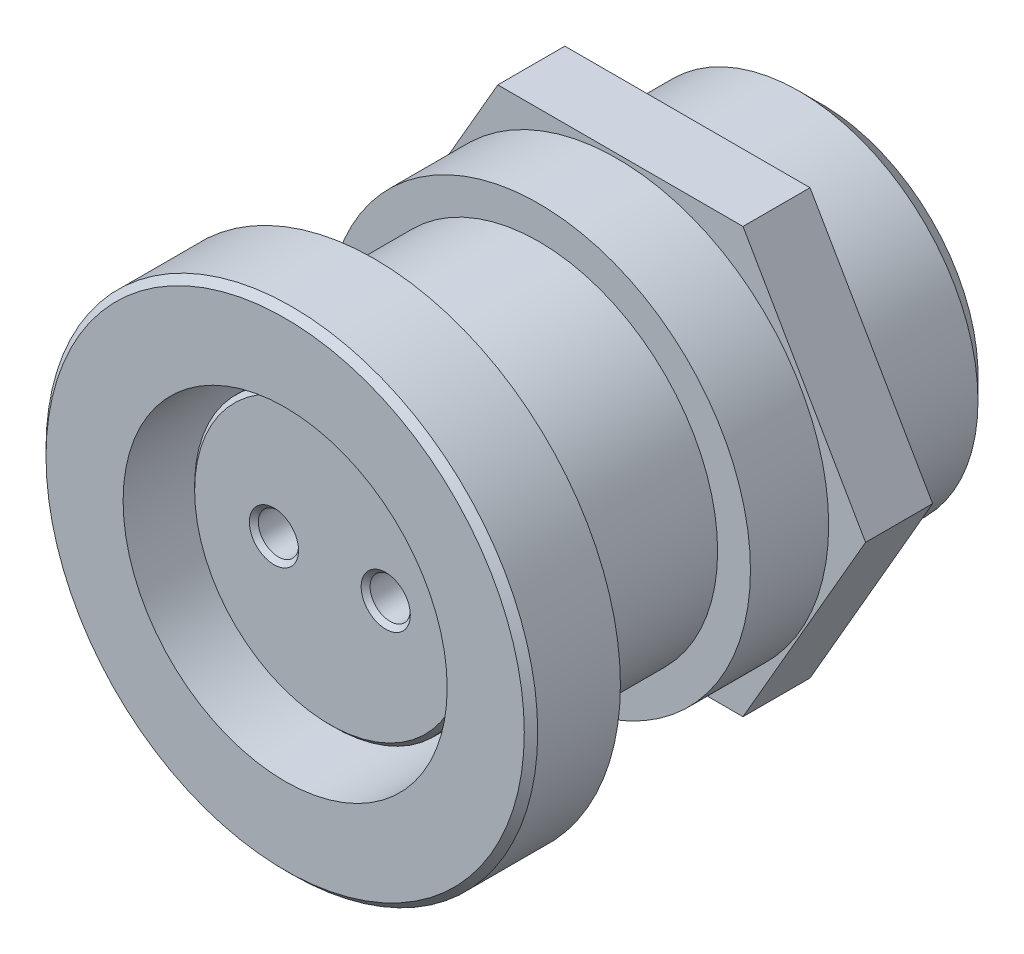
ISO-10303-21;
HEADER;
FILE_DESCRIPTION(('STEP AP214'),'2;1');
FILE_NAME('part.step','',(''),(''),'','','');
FILE_SCHEMA(('AUTOMOTIVE_DESIGN { 1 0 10303 214 1 1 1 1 }'));
ENDSEC;
DATA;
#1=APPLICATION_CONTEXT('core data for automotive mechanical design processes');
#2=APPLICATION_PROTOCOL_DEFINITION('international standard','automotive_design',2000,#1);
#3=PRODUCT_CONTEXT('',#1,'mechanical');
#4=PRODUCT('Part','Part','',(#3));
#5=PRODUCT_RELATED_PRODUCT_CATEGORY('part','',(#4));
#6=PRODUCT_DEFINITION_FORMATION('','',#4);
#7=PRODUCT_DEFINITION_CONTEXT('part definition',#1,'design');
#8=PRODUCT_DEFINITION('design','',#6,#7);
#9=PRODUCT_DEFINITION_SHAPE('','',#8);
#10=(LENGTH_UNIT() NAMED_UNIT(*) SI_UNIT(.MILLI.,.METRE.));
#11=(NAMED_UNIT(*) PLANE_ANGLE_UNIT() SI_UNIT($,.RADIAN.));
#12=(NAMED_UNIT(*) SI_UNIT($,.STERADIAN.) SOLID_ANGLE_UNIT());
#13=UNCERTAINTY_MEASURE_WITH_UNIT(LENGTH_MEASURE(1.E-05),#10,'distance_accuracy_value','');
#14=(GEOMETRIC_REPRESENTATION_CONTEXT(3) GLOBAL_UNCERTAINTY_ASSIGNED_CONTEXT((#13)) GLOBAL_UNIT_ASSIGNED_CONTEXT((#10,
#11,#12)) REPRESENTATION_CONTEXT('',''));
#15=CARTESIAN_POINT('',(0.,0.,0.));
#16=DIRECTION('',(0.,0.,1.));
#17=DIRECTION('',(1.,0.,0.));
#18=AXIS2_PLACEMENT_3D('',#15,#16,#17);
#19=CARTESIAN_POINT('',(0.,0.,-20.));
#20=DIRECTION('',(0.,0.,1.));
#21=DIRECTION('',(1.,0.,0.));
#22=AXIS2_PLACEMENT_3D('',#19,#20,#21);
#23=CYLINDRICAL_SURFACE('',#22,8.);
#24=CARTESIAN_POINT('',(0.,0.,0.));
#25=DIRECTION('',(0.,0.,1.));
#26=DIRECTION('',(1.,0.,0.));
#27=AXIS2_PLACEMENT_3D('',#24,#25,#26);
#28=CIRCLE('',#27,8.);
#29=CARTESIAN_POINT('',(8.,0.,0.));
#30=VERTEX_POINT('',#29);
#31=EDGE_CURVE('E186',#30,#30,#28,.F.);
#32=ORIENTED_EDGE('',*,*,#31,.T.);
#33=EDGE_LOOP('',(#32));
#34=FACE_BOUND('',#33,.T.);
#35=CARTESIAN_POINT('',(0.,0.,-7.35));
#36=DIRECTION('',(0.,0.,-1.));
#37=DIRECTION('',(-1.,0.,0.));
#38=AXIS2_PLACEMENT_3D('',#35,#36,#37);
#39=CIRCLE('',#38,8.);
#40=CARTESIAN_POINT('',(-8.,0.,-7.35));
#41=VERTEX_POINT('',#40);
#42=EDGE_CURVE('E42',#41,#41,#39,.T.);
#43=ORIENTED_EDGE('',*,*,#42,.F.);
#44=EDGE_LOOP('',(#43));
#45=FACE_BOUND('',#44,.T.);
#46=ADVANCED_FACE('F34',(#34,#45),#23,.T.);
#47=CARTESIAN_POINT('',(0.,0.,0.));
#48=DIRECTION('',(0.,0.,1.));
#49=DIRECTION('',(1.,0.,0.));
#50=AXIS2_PLACEMENT_3D('',#47,#48,#49);
#51=PLANE('',#50);
#52=CARTESIAN_POINT('',(0.,0.,0.));
#53=DIRECTION('',(0.,0.,-1.));
#54=DIRECTION('',(-1.,0.,0.));
#55=AXIS2_PLACEMENT_3D('',#52,#53,#54);
#56=CIRCLE('',#55,10.);
#57=CARTESIAN_POINT('',(-10.,0.,0.));
#58=VERTEX_POINT('',#57);
#59=EDGE_CURVE('E174',#58,#58,#56,.T.);
#60=ORIENTED_EDGE('',*,*,#59,.F.);
#61=EDGE_LOOP('',(#60));
#62=FACE_BOUND('',#61,.T.);
#63=CARTESIAN_POINT('',(0.,0.,0.));
#64=DIRECTION('',(0.,0.,1.));
#65=DIRECTION('',(1.,0.,0.));
#66=AXIS2_PLACEMENT_3D('',#63,#64,#65);
#67=CIRCLE('',#66,11.);
#68=CARTESIAN_POINT('',(11.,0.,0.));
#69=VERTEX_POINT('',#68);
#70=EDGE_CURVE('E183',#69,#69,#67,.T.);
#71=ORIENTED_EDGE('',*,*,#70,.F.);
#72=EDGE_LOOP('',(#71));
#73=FACE_BOUND('',#72,.T.);
#74=ADVANCED_FACE('F241',(#62,#73),#51,.F.);
#75=CARTESIAN_POINT('',(0.,0.,4.));
#76=DIRECTION('',(0.,0.,-1.));
#77=DIRECTION('',(-1.,0.,0.));
#78=AXIS2_PLACEMENT_3D('',#75,#76,#77);
#79=CYLINDRICAL_SURFACE('',#78,11.);
#80=CARTESIAN_POINT('',(0.,0.,3.7));
#81=DIRECTION('',(0.,0.,1.));
#82=DIRECTION('',(1.,0.,0.));
#83=AXIS2_PLACEMENT_3D('',#80,#81,#82);
#84=CIRCLE('',#83,11.);
#85=CARTESIAN_POINT('',(11.,0.,3.7));
#86=VERTEX_POINT('',#85);
#87=EDGE_CURVE('E198',#86,#86,#84,.F.);
#88=ORIENTED_EDGE('',*,*,#87,.T.);
#89=EDGE_LOOP('',(#88));
#90=FACE_BOUND('',#89,.T.);
#91=ORIENTED_EDGE('',*,*,#70,.T.);
#92=EDGE_LOOP('',(#91));
#93=FACE_BOUND('',#92,.T.);
#94=ADVANCED_FACE('F36',(#90,#93),#79,.T.);
#95=CARTESIAN_POINT('',(0.,0.,4.));
#96=DIRECTION('',(0.,0.,1.));
#97=DIRECTION('',(1.,0.,0.));
#98=AXIS2_PLACEMENT_3D('',#95,#96,#97);
#99=PLANE('',#98);
#100=CARTESIAN_POINT('',(0.,0.,4.));
#101=DIRECTION('',(0.,0.,1.));
#102=DIRECTION('',(1.,0.,0.));
#103=AXIS2_PLACEMENT_3D('',#100,#101,#102);
#104=CIRCLE('',#103,10.7);
#105=CARTESIAN_POINT('',(10.7,0.,4.));
#106=VERTEX_POINT('',#105);
#107=EDGE_CURVE('E195',#106,#106,#104,.T.);
#108=ORIENTED_EDGE('',*,*,#107,.T.);
#109=EDGE_LOOP('',(#108));
#110=FACE_BOUND('',#109,.T.);
#111=CARTESIAN_POINT('',(0.,0.,4.));
#112=DIRECTION('',(0.,0.,1.));
#113=DIRECTION('',(1.,0.,0.));
#114=AXIS2_PLACEMENT_3D('',#111,#112,#113);
#115=CIRCLE('',#114,7.25);
#116=CARTESIAN_POINT('',(7.25,0.,4.));
#117=VERTEX_POINT('',#116);
#118=EDGE_CURVE('E180',#117,#117,#115,.T.);
#119=ORIENTED_EDGE('',*,*,#118,.F.);
#120=EDGE_LOOP('',(#119));
#121=FACE_BOUND('',#120,.T.);
#122=ADVANCED_FACE('F339',(#110,#121),#99,.T.);
#123=CARTESIAN_POINT('',(0.,0.,-12.));
#124=DIRECTION('',(0.,0.,1.));
#125=DIRECTION('',(1.,0.,0.));
#126=AXIS2_PLACEMENT_3D('',#123,#124,#125);
#127=CYLINDRICAL_SURFACE('',#126,7.25);
#128=CARTESIAN_POINT('',(0.,0.,-11.));
#129=DIRECTION('',(0.,0.,1.));
#130=DIRECTION('',(1.,0.,0.));
#131=AXIS2_PLACEMENT_3D('',#128,#129,#130);
#132=CIRCLE('',#131,7.25);
#133=CARTESIAN_POINT('',(7.25,0.,-11.));
#134=VERTEX_POINT('',#133);
#135=EDGE_CURVE('E144',#134,#134,#132,.F.);
#136=ORIENTED_EDGE('',*,*,#135,.T.);
#137=EDGE_LOOP('',(#136));
#138=FACE_BOUND('',#137,.T.);
#139=ORIENTED_EDGE('',*,*,#118,.T.);
#140=EDGE_LOOP('',(#139));
#141=FACE_BOUND('',#140,.T.);
#142=ADVANCED_FACE('F325',(#138,#141),#127,.F.);
#143=CARTESIAN_POINT('',(0.,0.,4.));
#144=DIRECTION('',(0.,0.,-1.));
#145=DIRECTION('',(-1.,0.,0.));
#146=AXIS2_PLACEMENT_3D('',#143,#144,#145);
#147=CONICAL_SURFACE('',#146,10.7,0.785398163397445);
#148=ORIENTED_EDGE('',*,*,#87,.F.);
#149=EDGE_LOOP('',(#148));
#150=FACE_BOUND('',#149,.T.);
#151=ORIENTED_EDGE('',*,*,#107,.F.);
#152=EDGE_LOOP('',(#151));
#153=FACE_BOUND('',#152,.T.);
#154=ADVANCED_FACE('F321',(#150,#153),#147,.T.);
#155=CARTESIAN_POINT('',(0.,0.,1.5));
#156=DIRECTION('',(0.,0.,-1.));
#157=DIRECTION('',(-1.,0.,0.));
#158=AXIS2_PLACEMENT_3D('',#155,#156,#157);
#159=CYLINDRICAL_SURFACE('',#158,10.);
#160=CARTESIAN_POINT('',(0.,0.,1.5));
#161=DIRECTION('',(0.,0.,-1.));
#162=DIRECTION('',(-1.,0.,0.));
#163=AXIS2_PLACEMENT_3D('',#160,#161,#162);
#164=CIRCLE('',#163,10.);
#165=CARTESIAN_POINT('',(-10.,0.,1.5));
#166=VERTEX_POINT('',#165);
#167=EDGE_CURVE('E177',#166,#166,#164,.T.);
#168=ORIENTED_EDGE('',*,*,#167,.F.);
#169=EDGE_LOOP('',(#168));
#170=FACE_BOUND('',#169,.T.);
#171=ORIENTED_EDGE('',*,*,#59,.T.);
#172=EDGE_LOOP('',(#171));
#173=FACE_BOUND('',#172,.T.);
#174=ADVANCED_FACE('F317',(#170,#173),#159,.F.);
#175=CARTESIAN_POINT('',(0.,0.,1.5));
#176=DIRECTION('',(0.,0.,-1.));
#177=DIRECTION('',(-1.,0.,0.));
#178=AXIS2_PLACEMENT_3D('',#175,#176,#177);
#179=PLANE('',#178);
#180=CARTESIAN_POINT('',(0.,0.,1.5));
#181=DIRECTION('',(0.,0.,-1.));
#182=DIRECTION('',(-1.,0.,0.));
#183=AXIS2_PLACEMENT_3D('',#180,#181,#182);
#184=CIRCLE('',#183,8.25);
#185=CARTESIAN_POINT('',(-8.25,0.,1.5));
#186=VERTEX_POINT('',#185);
#187=EDGE_CURVE('E171',#186,#186,#184,.T.);
#188=ORIENTED_EDGE('',*,*,#187,.F.);
#189=EDGE_LOOP('',(#188));
#190=FACE_BOUND('',#189,.T.);
#191=ORIENTED_EDGE('',*,*,#167,.T.);
#192=EDGE_LOOP('',(#191));
#193=FACE_BOUND('',#192,.T.);
#194=ADVANCED_FACE('F313',(#190,#193),#179,.T.);
#195=CARTESIAN_POINT('',(0.,0.,1.5));
#196=DIRECTION('',(0.,0.,-1.));
#197=DIRECTION('',(-1.,0.,0.));
#198=AXIS2_PLACEMENT_3D('',#195,#196,#197);
#199=CYLINDRICAL_SURFACE('',#198,8.25);
#200=ORIENTED_EDGE('',*,*,#187,.T.);
#201=EDGE_LOOP('',(#200));
#202=FACE_BOUND('',#201,.T.);
#203=CARTESIAN_POINT('',(0.,0.,0.));
#204=DIRECTION('',(0.,0.,-1.));
#205=DIRECTION('',(-1.,0.,0.));
#206=AXIS2_PLACEMENT_3D('',#203,#204,#205);
#207=CIRCLE('',#206,8.25);
#208=CARTESIAN_POINT('',(-8.25,0.,0.));
#209=VERTEX_POINT('',#208);
#210=EDGE_CURVE('E168',#209,#209,#207,.T.);
#211=ORIENTED_EDGE('',*,*,#210,.F.);
#212=EDGE_LOOP('',(#211));
#213=FACE_BOUND('',#212,.T.);
#214=ADVANCED_FACE('F310',(#202,#213),#199,.T.);
#215=ORIENTED_EDGE('',*,*,#31,.F.);
#216=EDGE_LOOP('',(#215));
#217=FACE_BOUND('',#216,.T.);
#218=ORIENTED_EDGE('',*,*,#210,.T.);
#219=EDGE_LOOP('',(#218));
#220=FACE_BOUND('',#219,.T.);
#221=ADVANCED_FACE('F249',(#217,#220),#51,.F.);
#222=CARTESIAN_POINT('',(0.,0.,-10.85));
#223=DIRECTION('',(0.,0.,-1.));
#224=DIRECTION('',(-1.,0.,0.));
#225=AXIS2_PLACEMENT_3D('',#222,#223,#224);
#226=PLANE('',#225);
#227=CARTESIAN_POINT('',(0.,0.,-10.85));
#228=DIRECTION('',(0.,0.,-1.));
#229=DIRECTION('',(-1.,0.,0.));
#230=AXIS2_PLACEMENT_3D('',#227,#228,#229);
#231=CIRCLE('',#230,9.46912805354748);
#232=CARTESIAN_POINT('',(-9.46912805354748,0.,-10.85));
#233=VERTEX_POINT('',#232);
#234=EDGE_CURVE('E153',#233,#233,#231,.T.);
#235=ORIENTED_EDGE('',*,*,#234,.T.);
#236=EDGE_LOOP('',(#235));
#237=FACE_BOUND('',#236,.T.);
#238=CARTESIAN_POINT('',(0.,0.,-10.85));
#239=DIRECTION('',(0.,0.,-1.));
#240=DIRECTION('',(-1.,0.,0.));
#241=AXIS2_PLACEMENT_3D('',#238,#239,#240);
#242=CIRCLE('',#241,8.);
#243=CARTESIAN_POINT('',(-8.,0.,-10.85));
#244=VERTEX_POINT('',#243);
#245=EDGE_CURVE('E147',#244,#244,#242,.T.);
#246=ORIENTED_EDGE('',*,*,#245,.F.);
#247=EDGE_LOOP('',(#246));
#248=FACE_BOUND('',#247,.T.);
#249=ADVANCED_FACE('F377',(#237,#248),#226,.T.);
#250=CARTESIAN_POINT('',(0.,0.,-7.35));
#251=DIRECTION('',(0.,0.,-1.));
#252=DIRECTION('',(-1.,0.,0.));
#253=AXIS2_PLACEMENT_3D('',#250,#251,#252);
#254=PLANE('',#253);
#255=CARTESIAN_POINT('',(0.,0.,-7.35));
#256=DIRECTION('',(0.,0.,-1.));
#257=DIRECTION('',(-1.,0.,0.));
#258=AXIS2_PLACEMENT_3D('',#255,#256,#257);
#259=CIRCLE('',#258,9.46912805354748);
#260=CARTESIAN_POINT('',(-9.46912805354748,0.,-7.35));
#261=VERTEX_POINT('',#260);
#262=EDGE_CURVE('E150',#261,#261,#259,.T.);
#263=ORIENTED_EDGE('',*,*,#262,.F.);
#264=EDGE_LOOP('',(#263));
#265=FACE_BOUND('',#264,.T.);
#266=ORIENTED_EDGE('',*,*,#42,.T.);
#267=EDGE_LOOP('',(#266));
#268=FACE_BOUND('',#267,.T.);
#269=ADVANCED_FACE('F527',(#265,#268),#254,.F.);
#270=CARTESIAN_POINT('',(0.,0.,-10.85));
#271=DIRECTION('',(0.,0.,1.));
#272=DIRECTION('',(1.,0.,0.));
#273=AXIS2_PLACEMENT_3D('',#270,#271,#272);
#274=CYLINDRICAL_SURFACE('',#273,9.46912805354748);
#275=ORIENTED_EDGE('',*,*,#234,.F.);
#276=EDGE_LOOP('',(#275));
#277=FACE_BOUND('',#276,.T.);
#278=ORIENTED_EDGE('',*,*,#262,.T.);
#279=EDGE_LOOP('',(#278));
#280=FACE_BOUND('',#279,.T.);
#281=ADVANCED_FACE('F254',(#277,#280),#274,.T.);
#282=CARTESIAN_POINT('',(0.,0.,-11.));
#283=DIRECTION('',(0.,0.,1.));
#284=DIRECTION('',(1.,0.,0.));
#285=AXIS2_PLACEMENT_3D('',#282,#283,#284);
#286=CIRCLE('',#285,8.);
#287=CARTESIAN_POINT('',(8.,0.,-11.));
#288=VERTEX_POINT('',#287);
#289=EDGE_CURVE('E106',#288,#288,#286,.T.);
#290=ORIENTED_EDGE('',*,*,#289,.T.);
#291=EDGE_LOOP('',(#290));
#292=FACE_BOUND('',#291,.T.);
#293=ORIENTED_EDGE('',*,*,#245,.T.);
#294=EDGE_LOOP('',(#293));
#295=FACE_BOUND('',#294,.T.);
#296=ADVANCED_FACE('F223',(#292,#295),#23,.T.);
#297=CARTESIAN_POINT('',(5.48482755730144,9.5,-14.));
#298=DIRECTION('',(0.,-1.,0.));
#299=DIRECTION('',(0.,0.,-1.));
#300=AXIS2_PLACEMENT_3D('',#297,#298,#299);
#301=PLANE('',#300);
#302=DIRECTION('',(1.,0.,0.));
#303=VECTOR('',#302,1.);
#304=CARTESIAN_POINT('',(5.48482755730144,9.5,-11.));
#305=LINE('',#304,#303);
#306=CARTESIAN_POINT('',(-5.48482755730145,9.5,-11.));
#307=VERTEX_POINT('',#306);
#308=CARTESIAN_POINT('',(5.48482755730144,9.5,-11.));
#309=VERTEX_POINT('',#308);
#310=EDGE_CURVE('E119',#307,#309,#305,.T.);
#311=ORIENTED_EDGE('',*,*,#310,.T.);
#312=DIRECTION('',(0.,0.,1.));
#313=VECTOR('',#312,1.);
#314=CARTESIAN_POINT('',(5.48482755730144,9.5,-14.));
#315=LINE('',#314,#313);
#316=CARTESIAN_POINT('',(5.48482755730144,9.5,-14.));
#317=VERTEX_POINT('',#316);
#318=EDGE_CURVE('E111',#317,#309,#315,.T.);
#319=ORIENTED_EDGE('',*,*,#318,.F.);
#320=DIRECTION('',(1.,0.,0.));
#321=VECTOR('',#320,1.);
#322=CARTESIAN_POINT('',(5.48482755730144,9.5,-14.));
#323=LINE('',#322,#321);
#324=CARTESIAN_POINT('',(-5.48482755730145,9.5,-14.));
#325=VERTEX_POINT('',#324);
#326=EDGE_CURVE('E49',#325,#317,#323,.T.);
#327=ORIENTED_EDGE('',*,*,#326,.F.);
#328=DIRECTION('',(0.,0.,1.));
#329=VECTOR('',#328,1.);
#330=CARTESIAN_POINT('',(-5.48482755730145,9.5,-14.));
#331=LINE('',#330,#329);
#332=EDGE_CURVE('E131',#325,#307,#331,.T.);
#333=ORIENTED_EDGE('',*,*,#332,.T.);
#334=EDGE_LOOP('',(#311,#319,#327,#333));
#335=FACE_BOUND('',#334,.T.);
#336=ADVANCED_FACE('F253',(#335),#301,.F.);
#337=CARTESIAN_POINT('',(-5.48482755730145,9.5,-14.));
#338=DIRECTION('',(0.866025403784439,-0.499999999999999,0.));
#339=DIRECTION('',(0.5,0.866025403784439,0.));
#340=AXIS2_PLACEMENT_3D('',#337,#338,#339);
#341=PLANE('',#340);
#342=DIRECTION('',(0.5,0.866025403784439,0.));
#343=VECTOR('',#342,1.);
#344=CARTESIAN_POINT('',(-5.48482755730145,9.5,-11.));
#345=LINE('',#344,#343);
#346=CARTESIAN_POINT('',(-10.9696551146029,0.,-11.));
#347=VERTEX_POINT('',#346);
#348=EDGE_CURVE('E117',#347,#307,#345,.T.);
#349=ORIENTED_EDGE('',*,*,#348,.T.);
#350=ORIENTED_EDGE('',*,*,#332,.F.);
#351=DIRECTION('',(0.5,0.866025403784439,0.));
#352=VECTOR('',#351,1.);
#353=CARTESIAN_POINT('',(-5.48482755730145,9.5,-14.));
#354=LINE('',#353,#352);
#355=CARTESIAN_POINT('',(-10.9696551146029,0.,-14.));
#356=VERTEX_POINT('',#355);
#357=EDGE_CURVE('E54',#356,#325,#354,.T.);
#358=ORIENTED_EDGE('',*,*,#357,.F.);
#359=DIRECTION('',(0.,0.,1.));
#360=VECTOR('',#359,1.);
#361=CARTESIAN_POINT('',(-10.9696551146029,0.,-14.));
#362=LINE('',#361,#360);
#363=EDGE_CURVE('E134',#356,#347,#362,.T.);
#364=ORIENTED_EDGE('',*,*,#363,.T.);
#365=EDGE_LOOP('',(#349,#350,#358,#364));
#366=FACE_BOUND('',#365,.T.);
#367=ADVANCED_FACE('F497',(#366),#341,.F.);
#368=CARTESIAN_POINT('',(-10.9696551146029,0.,-14.));
#369=DIRECTION('',(0.866025403784439,0.499999999999999,0.));
#370=DIRECTION('',(-0.499999999999999,0.866025403784439,0.));
#371=AXIS2_PLACEMENT_3D('',#368,#369,#370);
#372=PLANE('',#371);
#373=DIRECTION('',(-0.499999999999999,0.866025403784439,0.));
#374=VECTOR('',#373,1.);
#375=CARTESIAN_POINT('',(-10.9696551146029,0.,-11.));
#376=LINE('',#375,#374);
#377=CARTESIAN_POINT('',(-5.48482755730145,-9.5,-11.));
#378=VERTEX_POINT('',#377);
#379=EDGE_CURVE('E115',#378,#347,#376,.T.);
#380=ORIENTED_EDGE('',*,*,#379,.T.);
#381=ORIENTED_EDGE('',*,*,#363,.F.);
#382=DIRECTION('',(-0.499999999999999,0.866025403784439,0.));
#383=VECTOR('',#382,1.);
#384=CARTESIAN_POINT('',(-10.9696551146029,0.,-14.));
#385=LINE('',#384,#383);
#386=CARTESIAN_POINT('',(-5.48482755730145,-9.5,-14.));
#387=VERTEX_POINT('',#386);
#388=EDGE_CURVE('E126',#387,#356,#385,.T.);
#389=ORIENTED_EDGE('',*,*,#388,.F.);
#390=DIRECTION('',(0.,0.,1.));
#391=VECTOR('',#390,1.);
#392=CARTESIAN_POINT('',(-5.48482755730145,-9.5,-14.));
#393=LINE('',#392,#391);
#394=EDGE_CURVE('E137',#387,#378,#393,.T.);
#395=ORIENTED_EDGE('',*,*,#394,.T.);
#396=EDGE_LOOP('',(#380,#381,#389,#395));
#397=FACE_BOUND('',#396,.T.);
#398=ADVANCED_FACE('F487',(#397),#372,.F.);
#399=CARTESIAN_POINT('',(-5.48482755730145,-9.5,-14.));
#400=DIRECTION('',(0.,1.,0.));
#401=DIRECTION('',(0.,0.,1.));
#402=AXIS2_PLACEMENT_3D('',#399,#400,#401);
#403=PLANE('',#402);
#404=DIRECTION('',(-1.,0.,0.));
#405=VECTOR('',#404,1.);
#406=CARTESIAN_POINT('',(-5.48482755730145,-9.5,-11.));
#407=LINE('',#406,#405);
#408=CARTESIAN_POINT('',(5.48482755730144,-9.5,-11.));
#409=VERTEX_POINT('',#408);
#410=EDGE_CURVE('E95',#409,#378,#407,.T.);
#411=ORIENTED_EDGE('',*,*,#410,.T.);
#412=ORIENTED_EDGE('',*,*,#394,.F.);
#413=DIRECTION('',(-1.,0.,0.));
#414=VECTOR('',#413,1.);
#415=CARTESIAN_POINT('',(-5.48482755730145,-9.5,-14.));
#416=LINE('',#415,#414);
#417=CARTESIAN_POINT('',(5.48482755730144,-9.5,-14.));
#418=VERTEX_POINT('',#417);
#419=EDGE_CURVE('E124',#418,#387,#416,.T.);
#420=ORIENTED_EDGE('',*,*,#419,.F.);
#421=DIRECTION('',(0.,0.,1.));
#422=VECTOR('',#421,1.);
#423=CARTESIAN_POINT('',(5.48482755730144,-9.5,-14.));
#424=LINE('',#423,#422);
#425=EDGE_CURVE('E107',#418,#409,#424,.T.);
#426=ORIENTED_EDGE('',*,*,#425,.T.);
#427=EDGE_LOOP('',(#411,#412,#420,#426));
#428=FACE_BOUND('',#427,.T.);
#429=ADVANCED_FACE('F478',(#428),#403,.F.);
#430=CARTESIAN_POINT('',(5.48482755730144,-9.5,-14.));
#431=DIRECTION('',(-0.866025403784438,0.5,0.));
#432=DIRECTION('',(-0.5,-0.866025403784439,0.));
#433=AXIS2_PLACEMENT_3D('',#430,#431,#432);
#434=PLANE('',#433);
#435=DIRECTION('',(-0.5,-0.866025403784439,0.));
#436=VECTOR('',#435,1.);
#437=CARTESIAN_POINT('',(5.48482755730144,-9.5,-11.));
#438=LINE('',#437,#436);
#439=CARTESIAN_POINT('',(10.9696551146029,0.,-11.));
#440=VERTEX_POINT('',#439);
#441=EDGE_CURVE('E87',#440,#409,#438,.T.);
#442=ORIENTED_EDGE('',*,*,#441,.T.);
#443=ORIENTED_EDGE('',*,*,#425,.F.);
#444=DIRECTION('',(-0.5,-0.866025403784439,0.));
#445=VECTOR('',#444,1.);
#446=CARTESIAN_POINT('',(5.48482755730144,-9.5,-14.));
#447=LINE('',#446,#445);
#448=CARTESIAN_POINT('',(10.9696551146029,0.,-14.));
#449=VERTEX_POINT('',#448);
#450=EDGE_CURVE('E103',#449,#418,#447,.T.);
#451=ORIENTED_EDGE('',*,*,#450,.F.);
#452=DIRECTION('',(0.,0.,1.));
#453=VECTOR('',#452,1.);
#454=CARTESIAN_POINT('',(10.9696551146029,0.,-14.));
#455=LINE('',#454,#453);
#456=EDGE_CURVE('E101',#449,#440,#455,.T.);
#457=ORIENTED_EDGE('',*,*,#456,.T.);
#458=EDGE_LOOP('',(#442,#443,#451,#457));
#459=FACE_BOUND('',#458,.T.);
#460=ADVANCED_FACE('F102',(#459),#434,.F.);
#461=CARTESIAN_POINT('',(10.9696551146029,0.,-14.));
#462=DIRECTION('',(-0.866025403784439,-0.5,0.));
#463=DIRECTION('',(0.5,-0.866025403784439,0.));
#464=AXIS2_PLACEMENT_3D('',#461,#462,#463);
#465=PLANE('',#464);
#466=DIRECTION('',(0.5,-0.866025403784439,0.));
#467=VECTOR('',#466,1.);
#468=CARTESIAN_POINT('',(10.9696551146029,0.,-11.));
#469=LINE('',#468,#467);
#470=EDGE_CURVE('E93',#309,#440,#469,.T.);
#471=ORIENTED_EDGE('',*,*,#470,.T.);
#472=ORIENTED_EDGE('',*,*,#456,.F.);
#473=DIRECTION('',(0.5,-0.866025403784439,0.));
#474=VECTOR('',#473,1.);
#475=CARTESIAN_POINT('',(10.9696551146029,0.,-14.));
#476=LINE('',#475,#474);
#477=EDGE_CURVE('E121',#317,#449,#476,.T.);
#478=ORIENTED_EDGE('',*,*,#477,.F.);
#479=ORIENTED_EDGE('',*,*,#318,.T.);
#480=EDGE_LOOP('',(#471,#472,#478,#479));
#481=FACE_BOUND('',#480,.T.);
#482=ADVANCED_FACE('F110',(#481),#465,.F.);
#483=CARTESIAN_POINT('',(5.48482755730144,9.5,-11.));
#484=DIRECTION('',(0.,0.,1.));
#485=DIRECTION('',(1.,0.,0.));
#486=AXIS2_PLACEMENT_3D('',#483,#484,#485);
#487=PLANE('',#486);
#488=ORIENTED_EDGE('',*,*,#470,.F.);
#489=ORIENTED_EDGE('',*,*,#310,.F.);
#490=ORIENTED_EDGE('',*,*,#348,.F.);
#491=ORIENTED_EDGE('',*,*,#379,.F.);
#492=ORIENTED_EDGE('',*,*,#410,.F.);
#493=ORIENTED_EDGE('',*,*,#441,.F.);
#494=EDGE_LOOP('',(#488,#489,#490,#491,#492,#493));
#495=FACE_BOUND('',#494,.T.);
#496=ORIENTED_EDGE('',*,*,#289,.F.);
#497=EDGE_LOOP('',(#496));
#498=FACE_BOUND('',#497,.T.);
#499=ADVANCED_FACE('F89',(#495,#498),#487,.T.);
#500=CARTESIAN_POINT('',(5.48482755730144,9.5,-14.));
#501=DIRECTION('',(0.,0.,1.));
#502=DIRECTION('',(1.,0.,0.));
#503=AXIS2_PLACEMENT_3D('',#500,#501,#502);
#504=PLANE('',#503);
#505=ORIENTED_EDGE('',*,*,#477,.T.);
#506=ORIENTED_EDGE('',*,*,#450,.T.);
#507=ORIENTED_EDGE('',*,*,#419,.T.);
#508=ORIENTED_EDGE('',*,*,#388,.T.);
#509=ORIENTED_EDGE('',*,*,#357,.T.);
#510=ORIENTED_EDGE('',*,*,#326,.T.);
#511=EDGE_LOOP('',(#505,#506,#507,#508,#509,#510));
#512=FACE_BOUND('',#511,.T.);
#513=CARTESIAN_POINT('',(0.,0.,-14.));
#514=DIRECTION('',(0.,0.,1.));
#515=DIRECTION('',(1.,0.,0.));
#516=AXIS2_PLACEMENT_3D('',#513,#514,#515);
#517=CIRCLE('',#516,8.);
#518=CARTESIAN_POINT('',(8.,0.,-14.));
#519=VERTEX_POINT('',#518);
#520=EDGE_CURVE('E11',#519,#519,#517,.T.);
#521=ORIENTED_EDGE('',*,*,#520,.T.);
#522=EDGE_LOOP('',(#521));
#523=FACE_BOUND('',#522,.T.);
#524=ADVANCED_FACE('F226',(#512,#523),#504,.F.);
#525=CARTESIAN_POINT('',(0.,0.,-18.));
#526=DIRECTION('',(0.,0.,-1.));
#527=DIRECTION('',(-1.,0.,0.));
#528=AXIS2_PLACEMENT_3D('',#525,#526,#527);
#529=PLANE('',#528);
#530=CARTESIAN_POINT('',(0.,0.,-18.));
#531=DIRECTION('',(0.,0.,-1.));
#532=DIRECTION('',(-1.,0.,0.));
#533=AXIS2_PLACEMENT_3D('',#530,#531,#532);
#534=CIRCLE('',#533,6.);
#535=CARTESIAN_POINT('',(-6.,0.,-18.));
#536=VERTEX_POINT('',#535);
#537=EDGE_CURVE('E159',#536,#536,#534,.T.);
#538=ORIENTED_EDGE('',*,*,#537,.T.);
#539=EDGE_LOOP('',(#538));
#540=FACE_BOUND('',#539,.T.);
#541=ADVANCED_FACE('F233',(#540),#529,.T.);
#542=CARTESIAN_POINT('',(0.,0.,-18.));
#543=DIRECTION('',(0.,0.,-1.));
#544=DIRECTION('',(-1.,0.,0.));
#545=AXIS2_PLACEMENT_3D('',#542,#543,#544);
#546=CYLINDRICAL_SURFACE('',#545,6.);
#547=ORIENTED_EDGE('',*,*,#537,.F.);
#548=EDGE_LOOP('',(#547));
#549=FACE_BOUND('',#548,.T.);
#550=CARTESIAN_POINT('',(0.,0.,-20.));
#551=DIRECTION('',(0.,0.,-1.));
#552=DIRECTION('',(-1.,0.,0.));
#553=AXIS2_PLACEMENT_3D('',#550,#551,#552);
#554=CIRCLE('',#553,6.);
#555=CARTESIAN_POINT('',(-6.,0.,-20.));
#556=VERTEX_POINT('',#555);
#557=EDGE_CURVE('E156',#556,#556,#554,.T.);
#558=ORIENTED_EDGE('',*,*,#557,.T.);
#559=EDGE_LOOP('',(#558));
#560=FACE_BOUND('',#559,.T.);
#561=ADVANCED_FACE('F273',(#549,#560),#546,.F.);
#562=CARTESIAN_POINT('',(0.,0.,-20.));
#563=DIRECTION('',(0.,0.,-1.));
#564=DIRECTION('',(-1.,0.,0.));
#565=AXIS2_PLACEMENT_3D('',#562,#563,#564);
#566=PLANE('',#565);
#567=CARTESIAN_POINT('',(0.,0.,-20.));
#568=DIRECTION('',(0.,0.,-1.));
#569=DIRECTION('',(-1.,0.,0.));
#570=AXIS2_PLACEMENT_3D('',#567,#568,#569);
#571=CIRCLE('',#570,7.);
#572=CARTESIAN_POINT('',(-7.,0.,-20.));
#573=VERTEX_POINT('',#572);
#574=EDGE_CURVE('E213',#573,#573,#571,.T.);
#575=ORIENTED_EDGE('',*,*,#574,.T.);
#576=EDGE_LOOP('',(#575));
#577=FACE_BOUND('',#576,.T.);
#578=ORIENTED_EDGE('',*,*,#557,.F.);
#579=EDGE_LOOP('',(#578));
#580=FACE_BOUND('',#579,.T.);
#581=ADVANCED_FACE('F261',(#577,#580),#566,.T.);
#582=CARTESIAN_POINT('',(0.,0.,-20.));
#583=DIRECTION('',(0.,0.,1.));
#584=DIRECTION('',(1.,0.,0.));
#585=AXIS2_PLACEMENT_3D('',#582,#583,#584);
#586=CONICAL_SURFACE('',#585,7.,0.785398163397445);
#587=CARTESIAN_POINT('',(0.,0.,-19.));
#588=DIRECTION('',(0.,0.,-1.));
#589=DIRECTION('',(-1.,0.,0.));
#590=AXIS2_PLACEMENT_3D('',#587,#588,#589);
#591=CIRCLE('',#590,8.);
#592=CARTESIAN_POINT('',(-8.,0.,-19.));
#593=VERTEX_POINT('',#592);
#594=EDGE_CURVE('E216',#593,#593,#591,.F.);
#595=ORIENTED_EDGE('',*,*,#594,.F.);
#596=EDGE_LOOP('',(#595));
#597=FACE_BOUND('',#596,.T.);
#598=ORIENTED_EDGE('',*,*,#574,.F.);
#599=EDGE_LOOP('',(#598));
#600=FACE_BOUND('',#599,.T.);
#601=ADVANCED_FACE('F256',(#597,#600),#586,.T.);
#602=ORIENTED_EDGE('',*,*,#594,.T.);
#603=EDGE_LOOP('',(#602));
#604=FACE_BOUND('',#603,.T.);
#605=ORIENTED_EDGE('',*,*,#520,.F.);
#606=EDGE_LOOP('',(#605));
#607=FACE_BOUND('',#606,.T.);
#608=ADVANCED_FACE('F238',(#604,#607),#23,.T.);
#609=CARTESIAN_POINT('',(0.,0.,-11.));
#610=DIRECTION('',(0.,0.,1.));
#611=DIRECTION('',(1.,0.,0.));
#612=AXIS2_PLACEMENT_3D('',#609,#610,#611);
#613=CIRCLE('',#612,6.25);
#614=CARTESIAN_POINT('',(6.25,0.,-11.));
#615=VERTEX_POINT('',#614);
#616=EDGE_CURVE('E141',#615,#615,#613,.T.);
#617=ORIENTED_EDGE('',*,*,#616,.F.);
#618=EDGE_LOOP('',(#617));
#619=FACE_BOUND('',#618,.T.);
#620=ORIENTED_EDGE('',*,*,#135,.F.);
#621=EDGE_LOOP('',(#620));
#622=FACE_BOUND('',#621,.T.);
#623=ADVANCED_FACE('F228',(#619,#622),#487,.T.);
#624=CARTESIAN_POINT('',(2.5,0.,-3.));
#625=DIRECTION('',(0.,0.,1.));
#626=DIRECTION('',(1.,0.,0.));
#627=AXIS2_PLACEMENT_3D('',#624,#625,#626);
#628=PLANE('',#627);
#629=CARTESIAN_POINT('',(2.5,0.,-3.));
#630=DIRECTION('',(0.,0.,1.));
#631=DIRECTION('',(1.,0.,0.));
#632=AXIS2_PLACEMENT_3D('',#629,#630,#631);
#633=CIRCLE('',#632,0.899999999999999);
#634=CARTESIAN_POINT('',(3.4,0.,-3.));
#635=VERTEX_POINT('',#634);
#636=EDGE_CURVE('E165',#635,#635,#633,.T.);
#637=ORIENTED_EDGE('',*,*,#636,.T.);
#638=EDGE_LOOP('',(#637));
#639=FACE_BOUND('',#638,.T.);
#640=ADVANCED_FACE('F237',(#639),#628,.T.);
#641=CARTESIAN_POINT('',(-2.5,0.,-3.));
#642=DIRECTION('',(0.,0.,1.));
#643=DIRECTION('',(1.,0.,0.));
#644=AXIS2_PLACEMENT_3D('',#641,#642,#643);
#645=PLANE('',#644);
#646=CARTESIAN_POINT('',(-2.5,0.,-3.));
#647=DIRECTION('',(0.,0.,1.));
#648=DIRECTION('',(1.,0.,0.));
#649=AXIS2_PLACEMENT_3D('',#646,#647,#648);
#650=CIRCLE('',#649,0.9);
#651=CARTESIAN_POINT('',(-1.6,0.,-3.));
#652=VERTEX_POINT('',#651);
#653=EDGE_CURVE('E162',#652,#652,#650,.T.);
#654=ORIENTED_EDGE('',*,*,#653,.T.);
#655=EDGE_LOOP('',(#654));
#656=FACE_BOUND('',#655,.T.);
#657=ADVANCED_FACE('F300',(#656),#645,.T.);
#658=CARTESIAN_POINT('',(2.5,0.,-3.));
#659=DIRECTION('',(0.,0.,1.));
#660=DIRECTION('',(1.,0.,0.));
#661=AXIS2_PLACEMENT_3D('',#658,#659,#660);
#662=CYLINDRICAL_SURFACE('',#661,0.899999999999999);
#663=CARTESIAN_POINT('',(2.5,0.,1.79999999999999));
#664=DIRECTION('',(0.,0.,1.));
#665=DIRECTION('',(1.,0.,0.));
#666=AXIS2_PLACEMENT_3D('',#663,#664,#665);
#667=CIRCLE('',#666,0.899999999999999);
#668=CARTESIAN_POINT('',(3.4,0.,1.79999999999999));
#669=VERTEX_POINT('',#668);
#670=EDGE_CURVE('E210',#669,#669,#667,.T.);
#671=ORIENTED_EDGE('',*,*,#670,.T.);
#672=EDGE_LOOP('',(#671));
#673=FACE_BOUND('',#672,.T.);
#674=ORIENTED_EDGE('',*,*,#636,.F.);
#675=EDGE_LOOP('',(#674));
#676=FACE_BOUND('',#675,.T.);
#677=ADVANCED_FACE('F298',(#673,#676),#662,.F.);
#678=CARTESIAN_POINT('',(-2.5,0.,-3.));
#679=DIRECTION('',(0.,0.,1.));
#680=DIRECTION('',(1.,0.,0.));
#681=AXIS2_PLACEMENT_3D('',#678,#679,#680);
#682=CYLINDRICAL_SURFACE('',#681,0.9);
#683=CARTESIAN_POINT('',(-2.5,0.,1.79999999999999));
#684=DIRECTION('',(0.,0.,1.));
#685=DIRECTION('',(1.,0.,0.));
#686=AXIS2_PLACEMENT_3D('',#683,#684,#685);
#687=CIRCLE('',#686,0.9);
#688=CARTESIAN_POINT('',(-1.6,0.,1.79999999999999));
#689=VERTEX_POINT('',#688);
#690=EDGE_CURVE('E201',#689,#689,#687,.T.);
#691=ORIENTED_EDGE('',*,*,#690,.T.);
#692=EDGE_LOOP('',(#691));
#693=FACE_BOUND('',#692,.T.);
#694=ORIENTED_EDGE('',*,*,#653,.F.);
#695=EDGE_LOOP('',(#694));
#696=FACE_BOUND('',#695,.T.);
#697=ADVANCED_FACE('F290',(#693,#696),#682,.F.);
#698=CARTESIAN_POINT('',(2.5,0.,1.79999999999999));
#699=DIRECTION('',(0.,0.,1.));
#700=DIRECTION('',(1.,0.,0.));
#701=AXIS2_PLACEMENT_3D('',#698,#699,#700);
#702=CONICAL_SURFACE('',#701,0.899999999999999,0.785398163397453);
#703=CARTESIAN_POINT('',(2.5,0.,2.));
#704=DIRECTION('',(0.,0.,1.));
#705=DIRECTION('',(1.,0.,0.));
#706=AXIS2_PLACEMENT_3D('',#703,#704,#705);
#707=CIRCLE('',#706,1.10000000000001);
#708=CARTESIAN_POINT('',(3.60000000000001,0.,2.));
#709=VERTEX_POINT('',#708);
#710=EDGE_CURVE('E204',#709,#709,#707,.F.);
#711=ORIENTED_EDGE('',*,*,#710,.F.);
#712=EDGE_LOOP('',(#711));
#713=FACE_BOUND('',#712,.T.);
#714=ORIENTED_EDGE('',*,*,#670,.F.);
#715=EDGE_LOOP('',(#714));
#716=FACE_BOUND('',#715,.T.);
#717=ADVANCED_FACE('F286',(#713,#716),#702,.F.);
#718=CARTESIAN_POINT('',(-2.5,0.,1.79999999999999));
#719=DIRECTION('',(0.,0.,1.));
#720=DIRECTION('',(1.,0.,0.));
#721=AXIS2_PLACEMENT_3D('',#718,#719,#720);
#722=CONICAL_SURFACE('',#721,0.9,0.785398163397453);
#723=CARTESIAN_POINT('',(-2.5,0.,2.));
#724=DIRECTION('',(0.,0.,1.));
#725=DIRECTION('',(1.,0.,0.));
#726=AXIS2_PLACEMENT_3D('',#723,#724,#725);
#727=CIRCLE('',#726,1.10000000000001);
#728=CARTESIAN_POINT('',(-1.39999999999999,0.,2.));
#729=VERTEX_POINT('',#728);
#730=EDGE_CURVE('E207',#729,#729,#727,.F.);
#731=ORIENTED_EDGE('',*,*,#730,.F.);
#732=EDGE_LOOP('',(#731));
#733=FACE_BOUND('',#732,.T.);
#734=ORIENTED_EDGE('',*,*,#690,.F.);
#735=EDGE_LOOP('',(#734));
#736=FACE_BOUND('',#735,.T.);
#737=ADVANCED_FACE('F289',(#733,#736),#722,.F.);
#738=CARTESIAN_POINT('',(0.,0.,2.));
#739=DIRECTION('',(0.,0.,1.));
#740=DIRECTION('',(1.,0.,0.));
#741=AXIS2_PLACEMENT_3D('',#738,#739,#740);
#742=PLANE('',#741);
#743=ORIENTED_EDGE('',*,*,#730,.T.);
#744=EDGE_LOOP('',(#743));
#745=FACE_BOUND('',#744,.T.);
#746=ORIENTED_EDGE('',*,*,#710,.T.);
#747=EDGE_LOOP('',(#746));
#748=FACE_BOUND('',#747,.T.);
#749=CARTESIAN_POINT('',(0.,0.,2.));
#750=DIRECTION('',(0.,0.,1.));
#751=DIRECTION('',(1.,0.,0.));
#752=AXIS2_PLACEMENT_3D('',#749,#750,#751);
#753=CIRCLE('',#752,6.05);
#754=CARTESIAN_POINT('',(6.05,0.,2.));
#755=VERTEX_POINT('',#754);
#756=EDGE_CURVE('E189',#755,#755,#753,.T.);
#757=ORIENTED_EDGE('',*,*,#756,.T.);
#758=EDGE_LOOP('',(#757));
#759=FACE_BOUND('',#758,.T.);
#760=ADVANCED_FACE('F294',(#745,#748,#759),#742,.T.);
#761=CARTESIAN_POINT('',(0.,0.,2.));
#762=DIRECTION('',(0.,0.,-1.));
#763=DIRECTION('',(-1.,0.,0.));
#764=AXIS2_PLACEMENT_3D('',#761,#762,#763);
#765=CONICAL_SURFACE('',#764,6.05,0.785398163397438);
#766=CARTESIAN_POINT('',(0.,0.,1.8));
#767=DIRECTION('',(0.,0.,1.));
#768=DIRECTION('',(1.,0.,0.));
#769=AXIS2_PLACEMENT_3D('',#766,#767,#768);
#770=CIRCLE('',#769,6.25);
#771=CARTESIAN_POINT('',(6.25,0.,1.8));
#772=VERTEX_POINT('',#771);
#773=EDGE_CURVE('E192',#772,#772,#770,.F.);
#774=ORIENTED_EDGE('',*,*,#773,.F.);
#775=EDGE_LOOP('',(#774));
#776=FACE_BOUND('',#775,.T.);
#777=ORIENTED_EDGE('',*,*,#756,.F.);
#778=EDGE_LOOP('',(#777));
#779=FACE_BOUND('',#778,.T.);
#780=ADVANCED_FACE('F327',(#776,#779),#765,.T.);
#781=CARTESIAN_POINT('',(0.,0.,2.));
#782=DIRECTION('',(0.,0.,-1.));
#783=DIRECTION('',(-1.,0.,0.));
#784=AXIS2_PLACEMENT_3D('',#781,#782,#783);
#785=CYLINDRICAL_SURFACE('',#784,6.25);
#786=ORIENTED_EDGE('',*,*,#616,.T.);
#787=EDGE_LOOP('',(#786));
#788=FACE_BOUND('',#787,.T.);
#789=ORIENTED_EDGE('',*,*,#773,.T.);
#790=EDGE_LOOP('',(#789));
#791=FACE_BOUND('',#790,.T.);
#792=ADVANCED_FACE('F330',(#788,#791),#785,.T.);
#793=CLOSED_SHELL('',(#46,#74,#94,#122,#142,#154,#174,#194,#214,#221,#249,#269,#281,#296,#336,
#367,#398,#429,#460,#482,#499,#524,#541,#561,#581,#601,#608,#623,#640,#657,#677,#697,#717,#737,
#760,#780,#792));
#794=MANIFOLD_SOLID_BREP('B2',#793);
#795=ADVANCED_BREP_SHAPE_REPRESENTATION('',(#18,#794),#14);
#796=SHAPE_DEFINITION_REPRESENTATION(#9,#795);
ENDSEC;
END-ISO-10303-21;
